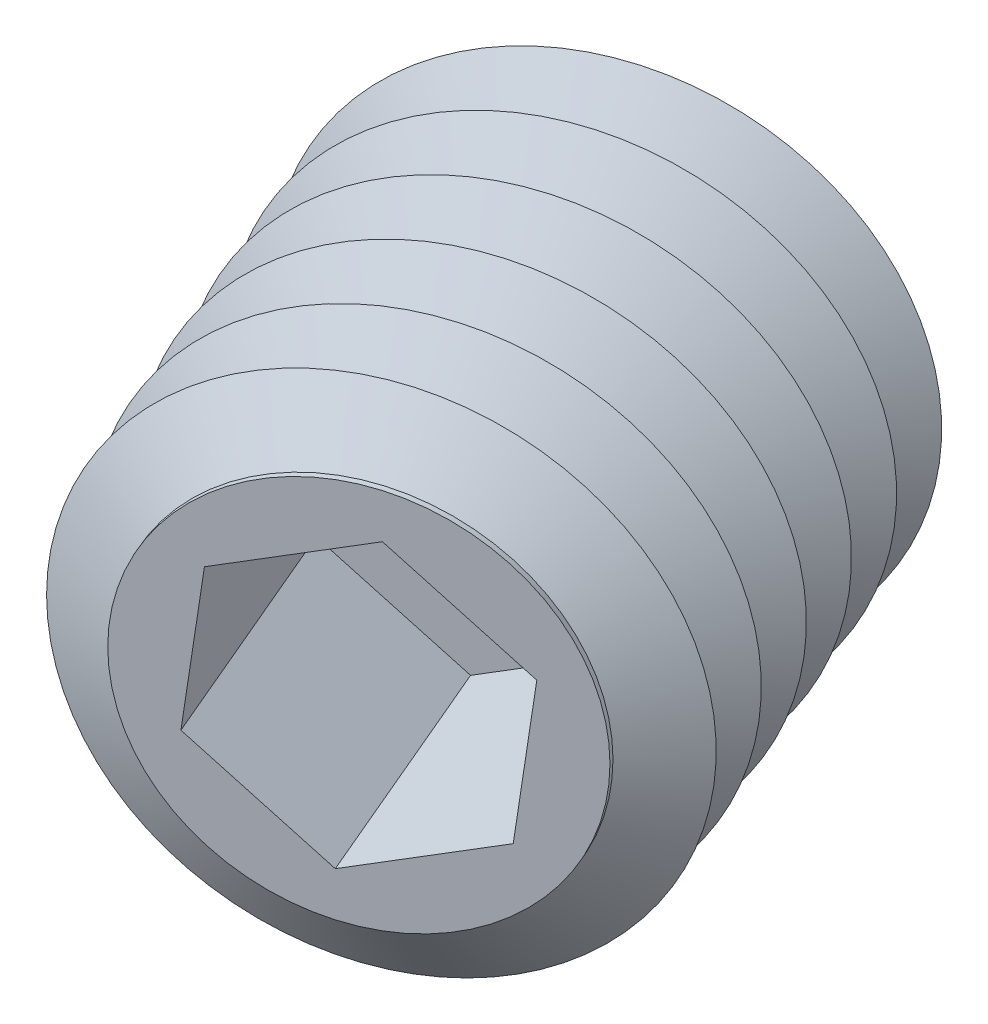
ISO-10303-21;
HEADER;
FILE_DESCRIPTION(('STEP AP214'),'2;1');
FILE_NAME('part.step','',(''),(''),'','','');
FILE_SCHEMA(('AUTOMOTIVE_DESIGN { 1 0 10303 214 1 1 1 1 }'));
ENDSEC;
DATA;
#1=APPLICATION_CONTEXT('core data for automotive mechanical design processes');
#2=APPLICATION_PROTOCOL_DEFINITION('international standard','automotive_design',2000,#1);
#3=PRODUCT_CONTEXT('',#1,'mechanical');
#4=PRODUCT('Part','Part','',(#3));
#5=PRODUCT_RELATED_PRODUCT_CATEGORY('part','',(#4));
#6=PRODUCT_DEFINITION_FORMATION('','',#4);
#7=PRODUCT_DEFINITION_CONTEXT('part definition',#1,'design');
#8=PRODUCT_DEFINITION('design','',#6,#7);
#9=PRODUCT_DEFINITION_SHAPE('','',#8);
#10=(LENGTH_UNIT() NAMED_UNIT(*) SI_UNIT(.MILLI.,.METRE.));
#11=(NAMED_UNIT(*) PLANE_ANGLE_UNIT() SI_UNIT($,.RADIAN.));
#12=(NAMED_UNIT(*) SI_UNIT($,.STERADIAN.) SOLID_ANGLE_UNIT());
#13=UNCERTAINTY_MEASURE_WITH_UNIT(LENGTH_MEASURE(1.E-05),#10,'distance_accuracy_value','');
#14=(GEOMETRIC_REPRESENTATION_CONTEXT(3) GLOBAL_UNCERTAINTY_ASSIGNED_CONTEXT((#13)) GLOBAL_UNIT_ASSIGNED_CONTEXT((#10,
#11,#12)) REPRESENTATION_CONTEXT('',''));
#15=CARTESIAN_POINT('',(0.,0.,0.));
#16=DIRECTION('',(0.,0.,1.));
#17=DIRECTION('',(1.,0.,0.));
#18=AXIS2_PLACEMENT_3D('',#15,#16,#17);
#19=CARTESIAN_POINT('',(53.6140702150309,-7.80000000000007,152.883076301382));
#20=DIRECTION('',(-0.390731128489286,0.,-0.920504853452435));
#21=DIRECTION('',(-0.920504853452435,0.,0.390731128489286));
#22=AXIS2_PLACEMENT_3D('',#19,#20,#21);
#23=CONICAL_SURFACE('',#22,1.99999999996604,0.785398163382625);
#24=CARTESIAN_POINT('',(54.3955324720193,-7.80000000000006,154.72408600831));
#25=VERTEX_POINT('',#24);
#26=VERTEX_LOOP('',#25);
#27=FACE_BOUND('',#26,.T.);
#28=CARTESIAN_POINT('',(53.6140702150309,-7.80000000000007,152.883076301382));
#29=DIRECTION('',(0.390731128489286,0.,0.920504853452435));
#30=DIRECTION('',(0.,-1.,0.));
#31=AXIS2_PLACEMENT_3D('',#28,#29,#30);
#32=CIRCLE('',#31,1.99999999996599);
#33=CARTESIAN_POINT('',(53.6140702150309,-9.79999999996606,152.883076301382));
#34=VERTEX_POINT('',#33);
#35=EDGE_CURVE('E331',#34,#34,#32,.T.);
#36=ORIENTED_EDGE('',*,*,#35,.F.);
#37=EDGE_LOOP('',(#36));
#38=FACE_BOUND('',#37,.T.);
#39=ADVANCED_FACE('F16',(#27,#38),#23,.F.);
#40=CARTESIAN_POINT('',(53.6271572263265,-7.80000000000007,152.913907367904));
#41=DIRECTION('',(0.390731128489274,0.,0.92050485345244));
#42=DIRECTION('',(0.,-1.,0.));
#43=AXIS2_PLACEMENT_3D('',#40,#41,#42);
#44=CYLINDRICAL_SURFACE('',#43,2.25);
#45=CARTESIAN_POINT('',(53.6140702150345,-7.80000000000007,152.883076301391));
#46=DIRECTION('',(-0.390731128489274,0.,-0.92050485345244));
#47=DIRECTION('',(-0.92050485345244,0.,0.390731128489274));
#48=AXIS2_PLACEMENT_3D('',#45,#46,#47);
#49=CIRCLE('',#48,2.25);
#50=CARTESIAN_POINT('',(51.5429342947665,-7.80000000000007,153.762221340491));
#51=VERTEX_POINT('',#50);
#52=EDGE_CURVE('E118',#51,#51,#49,.T.);
#53=ORIENTED_EDGE('',*,*,#52,.F.);
#54=EDGE_LOOP('',(#53));
#55=FACE_BOUND('',#54,.T.);
#56=CARTESIAN_POINT('',(53.6402442376186,-7.80000000000007,152.944738434418));
#57=DIRECTION('',(-0.390731128489274,0.,-0.92050485345244));
#58=DIRECTION('',(-0.92050485345244,0.,0.390731128489274));
#59=AXIS2_PLACEMENT_3D('',#56,#57,#58);
#60=CIRCLE('',#59,2.25);
#61=CARTESIAN_POINT('',(51.5691083173506,-7.80000000000007,153.823883473519));
#62=VERTEX_POINT('',#61);
#63=EDGE_CURVE('E11',#62,#62,#60,.T.);
#64=ORIENTED_EDGE('',*,*,#63,.T.);
#65=EDGE_LOOP('',(#64));
#66=FACE_BOUND('',#65,.T.);
#67=ADVANCED_FACE('F135',(#55,#66),#44,.T.);
#68=CARTESIAN_POINT('',(53.8094357793032,-7.80000000000007,153.343328728173));
#69=DIRECTION('',(0.39073112848927,0.,0.920504853452442));
#70=DIRECTION('',(0.,-1.,0.));
#71=AXIS2_PLACEMENT_3D('',#68,#69,#70);
#72=CONICAL_SURFACE('',#71,3.00000000007299,1.04719755118371);
#73=ORIENTED_EDGE('',*,*,#63,.F.);
#74=EDGE_LOOP('',(#73));
#75=FACE_BOUND('',#74,.T.);
#76=CARTESIAN_POINT('',(53.8094357792894,-7.80000000000007,153.343328728141));
#77=DIRECTION('',(-0.390731128489274,0.,-0.92050485345244));
#78=DIRECTION('',(-0.92050485345244,0.,0.390731128489274));
#79=AXIS2_PLACEMENT_3D('',#76,#77,#78);
#80=CIRCLE('',#79,3.00000000001884);
#81=CARTESIAN_POINT('',(51.0479212189147,-7.80000000000007,154.515522113616));
#82=VERTEX_POINT('',#81);
#83=EDGE_CURVE('E25',#82,#82,#80,.T.);
#84=ORIENTED_EDGE('',*,*,#83,.T.);
#85=EDGE_LOOP('',(#84));
#86=FACE_BOUND('',#85,.T.);
#87=ADVANCED_FACE('F140',(#75,#86),#72,.T.);
#88=CARTESIAN_POINT('',(53.8094357793165,-7.80000000000007,153.343328728205));
#89=DIRECTION('',(-0.390731128489284,0.,-0.920504853452436));
#90=DIRECTION('',(-0.920504853452436,0.,0.390731128489284));
#91=AXIS2_PLACEMENT_3D('',#88,#89,#90);
#92=CONICAL_SURFACE('',#91,2.9999999999349,1.04719755118649);
#93=CARTESIAN_POINT('',(53.9786273209611,-7.80000000000007,153.741919021866));
#94=DIRECTION('',(-0.390731128489274,0.,-0.92050485345244));
#95=DIRECTION('',(-0.92050485345244,0.,0.390731128489274));
#96=AXIS2_PLACEMENT_3D('',#93,#94,#95);
#97=CIRCLE('',#96,2.24999999997654);
#98=CARTESIAN_POINT('',(51.9074914007147,-7.80000000000007,154.621064060957));
#99=VERTEX_POINT('',#98);
#100=EDGE_CURVE('E337',#99,#99,#97,.T.);
#101=ORIENTED_EDGE('',*,*,#100,.T.);
#102=EDGE_LOOP('',(#101));
#103=FACE_BOUND('',#102,.T.);
#104=ORIENTED_EDGE('',*,*,#83,.F.);
#105=EDGE_LOOP('',(#104));
#106=FACE_BOUND('',#105,.T.);
#107=ADVANCED_FACE('F152',(#103,#106),#92,.T.);
#108=CARTESIAN_POINT('',(54.0048013435238,-7.80000000000007,153.803581154843));
#109=DIRECTION('',(0.390731128489274,0.,0.92050485345244));
#110=DIRECTION('',(0.,-1.,0.));
#111=AXIS2_PLACEMENT_3D('',#108,#109,#110);
#112=CYLINDRICAL_SURFACE('',#111,2.25);
#113=ORIENTED_EDGE('',*,*,#100,.F.);
#114=EDGE_LOOP('',(#113));
#115=FACE_BOUND('',#114,.T.);
#116=CARTESIAN_POINT('',(54.0309753661079,-7.80000000000007,153.865243287871));
#117=DIRECTION('',(-0.390731128489274,0.,-0.92050485345244));
#118=DIRECTION('',(-0.92050485345244,0.,0.390731128489274));
#119=AXIS2_PLACEMENT_3D('',#116,#117,#118);
#120=CIRCLE('',#119,2.25);
#121=CARTESIAN_POINT('',(51.9598394458399,-7.80000000000007,154.744388326972));
#122=VERTEX_POINT('',#121);
#123=EDGE_CURVE('E340',#122,#122,#120,.T.);
#124=ORIENTED_EDGE('',*,*,#123,.T.);
#125=EDGE_LOOP('',(#124));
#126=FACE_BOUND('',#125,.T.);
#127=ADVANCED_FACE('F148',(#115,#126),#112,.T.);
#128=CARTESIAN_POINT('',(54.2001669077402,-7.80000000000007,154.263833581503));
#129=DIRECTION('',(0.390731128489276,0.,0.920504853452439));
#130=DIRECTION('',(0.,-1.,0.));
#131=AXIS2_PLACEMENT_3D('',#128,#129,#130);
#132=CONICAL_SURFACE('',#131,2.99999999989111,1.04719755120376);
#133=ORIENTED_EDGE('',*,*,#123,.F.);
#134=EDGE_LOOP('',(#133));
#135=FACE_BOUND('',#134,.T.);
#136=CARTESIAN_POINT('',(54.2001669077627,-7.80000000000007,154.263833581556));
#137=DIRECTION('',(-0.390731128489274,0.,-0.92050485345244));
#138=DIRECTION('',(-0.92050485345244,0.,0.390731128489274));
#139=AXIS2_PLACEMENT_3D('',#136,#137,#138);
#140=CIRCLE('',#139,2.99999999999343);
#141=CARTESIAN_POINT('',(51.4386523474114,-7.80000000000007,155.436026967021));
#142=VERTEX_POINT('',#141);
#143=EDGE_CURVE('E343',#142,#142,#140,.T.);
#144=ORIENTED_EDGE('',*,*,#143,.T.);
#145=EDGE_LOOP('',(#144));
#146=FACE_BOUND('',#145,.T.);
#147=ADVANCED_FACE('F151',(#135,#146),#132,.T.);
#148=CARTESIAN_POINT('',(54.2001669077847,-7.80000000000007,154.263833581608));
#149=DIRECTION('',(-0.390731128489268,0.,-0.920504853452443));
#150=DIRECTION('',(-0.920504853452443,0.,0.390731128489268));
#151=AXIS2_PLACEMENT_3D('',#148,#149,#150);
#152=CONICAL_SURFACE('',#151,2.99999999991459,1.04719755120466);
#153=CARTESIAN_POINT('',(54.3693584494292,-7.80000000000007,154.662423875268));
#154=DIRECTION('',(-0.390731128489274,0.,-0.92050485345244));
#155=DIRECTION('',(-0.92050485345244,0.,0.390731128489274));
#156=AXIS2_PLACEMENT_3D('',#153,#154,#155);
#157=CIRCLE('',#156,2.24999999995626);
#158=CARTESIAN_POINT('',(52.2982225292015,-7.80000000000007,155.541568914352));
#159=VERTEX_POINT('',#158);
#160=EDGE_CURVE('E346',#159,#159,#157,.T.);
#161=ORIENTED_EDGE('',*,*,#160,.T.);
#162=EDGE_LOOP('',(#161));
#163=FACE_BOUND('',#162,.T.);
#164=ORIENTED_EDGE('',*,*,#143,.F.);
#165=EDGE_LOOP('',(#164));
#166=FACE_BOUND('',#165,.T.);
#167=ADVANCED_FACE('F164',(#163,#166),#152,.T.);
#168=CARTESIAN_POINT('',(54.395532472013,-7.80000000000007,154.724086008295));
#169=DIRECTION('',(0.390731128489274,0.,0.92050485345244));
#170=DIRECTION('',(0.,-1.,0.));
#171=AXIS2_PLACEMENT_3D('',#168,#169,#170);
#172=CYLINDRICAL_SURFACE('',#171,2.25);
#173=ORIENTED_EDGE('',*,*,#160,.F.);
#174=EDGE_LOOP('',(#173));
#175=FACE_BOUND('',#174,.T.);
#176=CARTESIAN_POINT('',(54.4217064945971,-7.80000000000007,154.785748141323));
#177=DIRECTION('',(-0.390731128489274,0.,-0.92050485345244));
#178=DIRECTION('',(-0.92050485345244,0.,0.390731128489274));
#179=AXIS2_PLACEMENT_3D('',#176,#177,#178);
#180=CIRCLE('',#179,2.25);
#181=CARTESIAN_POINT('',(52.3505705743291,-7.80000000000007,155.664893180424));
#182=VERTEX_POINT('',#181);
#183=EDGE_CURVE('E349',#182,#182,#180,.T.);
#184=ORIENTED_EDGE('',*,*,#183,.T.);
#185=EDGE_LOOP('',(#184));
#186=FACE_BOUND('',#185,.T.);
#187=ADVANCED_FACE('F160',(#175,#186),#172,.T.);
#188=CARTESIAN_POINT('',(54.59089803626,-7.80000000000007,155.184338435027));
#189=DIRECTION('',(0.390731128489276,0.,0.920504853452439));
#190=DIRECTION('',(0.,-1.,0.));
#191=AXIS2_PLACEMENT_3D('',#188,#189,#190);
#192=CONICAL_SURFACE('',#191,3.000000000012,1.04719755121017);
#193=ORIENTED_EDGE('',*,*,#183,.F.);
#194=EDGE_LOOP('',(#193));
#195=FACE_BOUND('',#194,.T.);
#196=CARTESIAN_POINT('',(54.59089803626,-7.80000000000007,155.184338435027));
#197=DIRECTION('',(-0.390731128489274,0.,-0.92050485345244));
#198=DIRECTION('',(-0.92050485345244,0.,0.390731128489274));
#199=AXIS2_PLACEMENT_3D('',#196,#197,#198);
#200=CIRCLE('',#199,3.00000000001199);
#201=CARTESIAN_POINT('',(51.8293834758916,-7.80000000000007,156.3565318205));
#202=VERTEX_POINT('',#201);
#203=EDGE_CURVE('E352',#202,#202,#200,.T.);
#204=ORIENTED_EDGE('',*,*,#203,.T.);
#205=EDGE_LOOP('',(#204));
#206=FACE_BOUND('',#205,.T.);
#207=ADVANCED_FACE('F163',(#195,#206),#192,.T.);
#208=CARTESIAN_POINT('',(54.5908980362615,-7.80000000000007,155.184338435031));
#209=DIRECTION('',(-0.390731128489273,0.,-0.920504853452441));
#210=DIRECTION('',(-0.920504853452441,0.,0.390731128489273));
#211=AXIS2_PLACEMENT_3D('',#208,#209,#210);
#212=CONICAL_SURFACE('',#211,2.99999999994251,1.04719755118876);
#213=CARTESIAN_POINT('',(54.7600895779265,-7.80000000000007,155.58292872874));
#214=DIRECTION('',(-0.390731128489274,0.,-0.92050485345244));
#215=DIRECTION('',(-0.92050485345244,0.,0.390731128489274));
#216=AXIS2_PLACEMENT_3D('',#213,#214,#215);
#217=CIRCLE('',#216,2.24999999997484);
#218=CARTESIAN_POINT('',(52.6889536576817,-7.80000000000007,156.462073767831));
#219=VERTEX_POINT('',#218);
#220=EDGE_CURVE('E355',#219,#219,#217,.T.);
#221=ORIENTED_EDGE('',*,*,#220,.T.);
#222=EDGE_LOOP('',(#221));
#223=FACE_BOUND('',#222,.T.);
#224=ORIENTED_EDGE('',*,*,#203,.F.);
#225=EDGE_LOOP('',(#224));
#226=FACE_BOUND('',#225,.T.);
#227=ADVANCED_FACE('F158',(#223,#226),#212,.T.);
#228=CARTESIAN_POINT('',(54.7862636005023,-7.80000000000007,155.644590861748));
#229=DIRECTION('',(0.390731128489274,0.,0.92050485345244));
#230=DIRECTION('',(0.,-1.,0.));
#231=AXIS2_PLACEMENT_3D('',#228,#229,#230);
#232=CYLINDRICAL_SURFACE('',#231,2.25);
#233=ORIENTED_EDGE('',*,*,#220,.F.);
#234=EDGE_LOOP('',(#233));
#235=FACE_BOUND('',#234,.T.);
#236=CARTESIAN_POINT('',(54.8124376230864,-7.80000000000007,155.706252994776));
#237=DIRECTION('',(-0.390731128489274,0.,-0.92050485345244));
#238=DIRECTION('',(-0.92050485345244,0.,0.390731128489274));
#239=AXIS2_PLACEMENT_3D('',#236,#237,#238);
#240=CIRCLE('',#239,2.25);
#241=CARTESIAN_POINT('',(52.7413017028184,-7.80000000000007,156.585398033877));
#242=VERTEX_POINT('',#241);
#243=EDGE_CURVE('E358',#242,#242,#240,.T.);
#244=ORIENTED_EDGE('',*,*,#243,.T.);
#245=EDGE_LOOP('',(#244));
#246=FACE_BOUND('',#245,.T.);
#247=ADVANCED_FACE('F154',(#235,#246),#232,.T.);
#248=CARTESIAN_POINT('',(54.9816291647746,-7.80000000000007,156.104843288539));
#249=DIRECTION('',(0.390731128489275,0.,0.92050485345244));
#250=DIRECTION('',(0.,-1.,0.));
#251=AXIS2_PLACEMENT_3D('',#248,#249,#250);
#252=CONICAL_SURFACE('',#251,3.00000000013798,1.04719755119727);
#253=ORIENTED_EDGE('',*,*,#243,.F.);
#254=EDGE_LOOP('',(#253));
#255=FACE_BOUND('',#254,.T.);
#256=CARTESIAN_POINT('',(54.9816291647521,-7.80000000000007,156.104843288486));
#257=DIRECTION('',(-0.390731128489274,0.,-0.92050485345244));
#258=DIRECTION('',(-0.92050485345244,0.,0.390731128489274));
#259=AXIS2_PLACEMENT_3D('',#256,#257,#258);
#260=CIRCLE('',#259,3.00000000002455);
#261=CARTESIAN_POINT('',(52.2201146043722,-7.80000000000007,157.277036673964));
#262=VERTEX_POINT('',#261);
#263=EDGE_CURVE('E361',#262,#262,#260,.T.);
#264=ORIENTED_EDGE('',*,*,#263,.T.);
#265=EDGE_LOOP('',(#264));
#266=FACE_BOUND('',#265,.T.);
#267=ADVANCED_FACE('F157',(#255,#266),#252,.T.);
#268=CARTESIAN_POINT('',(54.9816291647706,-7.80000000000007,156.10484328853));
#269=DIRECTION('',(-0.390731128489278,0.,-0.920504853452439));
#270=DIRECTION('',(-0.920504853452439,0.,0.390731128489278));
#271=AXIS2_PLACEMENT_3D('',#268,#269,#270);
#272=CONICAL_SURFACE('',#271,2.99999999987023,1.04719755119106);
#273=CARTESIAN_POINT('',(55.1508207064034,-7.80000000000007,156.503433582163));
#274=DIRECTION('',(-0.390731128489274,0.,-0.92050485345244));
#275=DIRECTION('',(-0.92050485345244,0.,0.390731128489274));
#276=AXIS2_PLACEMENT_3D('',#273,#274,#275);
#277=CIRCLE('',#276,2.25000000000271);
#278=CARTESIAN_POINT('',(53.0796847861329,-7.80000000000007,157.382578621265));
#279=VERTEX_POINT('',#278);
#280=EDGE_CURVE('E226',#279,#279,#277,.T.);
#281=ORIENTED_EDGE('',*,*,#280,.T.);
#282=EDGE_LOOP('',(#281));
#283=FACE_BOUND('',#282,.T.);
#284=ORIENTED_EDGE('',*,*,#263,.F.);
#285=EDGE_LOOP('',(#284));
#286=FACE_BOUND('',#285,.T.);
#287=ADVANCED_FACE('F176',(#283,#286),#272,.T.);
#288=CARTESIAN_POINT('',(55.1769947289916,-7.80000000000007,156.5650957152));
#289=DIRECTION('',(0.390731128489274,0.,0.92050485345244));
#290=DIRECTION('',(0.,-1.,0.));
#291=AXIS2_PLACEMENT_3D('',#288,#289,#290);
#292=CYLINDRICAL_SURFACE('',#291,2.25);
#293=ORIENTED_EDGE('',*,*,#280,.F.);
#294=EDGE_LOOP('',(#293));
#295=FACE_BOUND('',#294,.T.);
#296=CARTESIAN_POINT('',(55.2031687515757,-7.80000000000007,156.626757848228));
#297=DIRECTION('',(-0.390731128489274,0.,-0.92050485345244));
#298=DIRECTION('',(-0.92050485345244,0.,0.390731128489274));
#299=AXIS2_PLACEMENT_3D('',#296,#297,#298);
#300=CIRCLE('',#299,2.25);
#301=CARTESIAN_POINT('',(53.1320328313077,-7.80000000000007,157.505902887329));
#302=VERTEX_POINT('',#301);
#303=EDGE_CURVE('E219',#302,#302,#300,.T.);
#304=ORIENTED_EDGE('',*,*,#303,.T.);
#305=EDGE_LOOP('',(#304));
#306=FACE_BOUND('',#305,.T.);
#307=ADVANCED_FACE('F172',(#295,#306),#292,.T.);
#308=CARTESIAN_POINT('',(55.3723602932356,-7.80000000000007,157.025348141925));
#309=DIRECTION('',(0.390731128489277,0.,0.920504853452439));
#310=DIRECTION('',(0.,-1.,0.));
#311=AXIS2_PLACEMENT_3D('',#308,#309,#310);
#312=CONICAL_SURFACE('',#311,2.99999999996675,1.04719755117974);
#313=ORIENTED_EDGE('',*,*,#303,.F.);
#314=EDGE_LOOP('',(#313));
#315=FACE_BOUND('',#314,.T.);
#316=CARTESIAN_POINT('',(55.3723602932356,-7.80000000000007,157.025348141925));
#317=DIRECTION('',(-0.390731128489274,0.,-0.92050485345244));
#318=DIRECTION('',(-0.92050485345244,0.,0.390731128489274));
#319=AXIS2_PLACEMENT_3D('',#316,#317,#318);
#320=CIRCLE('',#319,2.99999999996674);
#321=CARTESIAN_POINT('',(52.6108457329089,-7.80000000000007,158.19754152738));
#322=VERTEX_POINT('',#321);
#323=EDGE_CURVE('E222',#322,#322,#320,.T.);
#324=ORIENTED_EDGE('',*,*,#323,.T.);
#325=EDGE_LOOP('',(#324));
#326=FACE_BOUND('',#325,.T.);
#327=ADVANCED_FACE('F175',(#315,#326),#312,.T.);
#328=CARTESIAN_POINT('',(55.3723602932679,-7.80000000000007,157.025348142001));
#329=DIRECTION('',(-0.390731128489272,0.,-0.920504853452441));
#330=DIRECTION('',(-0.920504853452441,0.,0.390731128489272));
#331=AXIS2_PLACEMENT_3D('',#328,#329,#330);
#332=CONICAL_SURFACE('',#331,2.99999999987769,1.04719755123238);
#333=CARTESIAN_POINT('',(55.5415518349007,-7.80000000000007,157.423938435634));
#334=DIRECTION('',(-0.390731128489274,0.,-0.92050485345244));
#335=DIRECTION('',(-0.92050485345244,0.,0.390731128489274));
#336=AXIS2_PLACEMENT_3D('',#333,#334,#335);
#337=CIRCLE('',#336,2.25000000001016);
#338=CARTESIAN_POINT('',(53.4704159146233,-7.80000000000007,158.303083474739));
#339=VERTEX_POINT('',#338);
#340=EDGE_CURVE('E224',#339,#339,#337,.T.);
#341=ORIENTED_EDGE('',*,*,#340,.T.);
#342=EDGE_LOOP('',(#341));
#343=FACE_BOUND('',#342,.T.);
#344=ORIENTED_EDGE('',*,*,#323,.F.);
#345=EDGE_LOOP('',(#344));
#346=FACE_BOUND('',#345,.T.);
#347=ADVANCED_FACE('F181',(#343,#346),#332,.T.);
#348=CARTESIAN_POINT('',(55.5677258574809,-7.80000000000007,157.485600568653));
#349=DIRECTION('',(0.390731128489274,0.,0.92050485345244));
#350=DIRECTION('',(0.,-1.,0.));
#351=AXIS2_PLACEMENT_3D('',#348,#349,#350);
#352=CYLINDRICAL_SURFACE('',#351,2.25);
#353=ORIENTED_EDGE('',*,*,#340,.F.);
#354=EDGE_LOOP('',(#353));
#355=FACE_BOUND('',#354,.T.);
#356=CARTESIAN_POINT('',(55.5938998800649,-7.80000000000007,157.547262701681));
#357=DIRECTION('',(-0.390731128489274,0.,-0.92050485345244));
#358=DIRECTION('',(-0.92050485345244,0.,0.390731128489274));
#359=AXIS2_PLACEMENT_3D('',#356,#357,#358);
#360=CIRCLE('',#359,2.25);
#361=CARTESIAN_POINT('',(53.522763959797,-7.80000000000007,158.426407740781));
#362=VERTEX_POINT('',#361);
#363=EDGE_CURVE('E229',#362,#362,#360,.T.);
#364=ORIENTED_EDGE('',*,*,#363,.T.);
#365=EDGE_LOOP('',(#364));
#366=FACE_BOUND('',#365,.T.);
#367=ADVANCED_FACE('F184',(#355,#366),#352,.T.);
#368=CARTESIAN_POINT('',(55.7630914217641,-7.80000000000007,157.94585299547));
#369=DIRECTION('',(0.390731128489277,0.,0.920504853452439));
#370=DIRECTION('',(0.,-1.,0.));
#371=AXIS2_PLACEMENT_3D('',#368,#369,#370);
#372=CONICAL_SURFACE('',#371,3.00000000014688,1.04719755119729);
#373=ORIENTED_EDGE('',*,*,#363,.F.);
#374=EDGE_LOOP('',(#373));
#375=FACE_BOUND('',#374,.T.);
#376=CARTESIAN_POINT('',(55.7630914217365,-7.80000000000007,157.945852995405));
#377=DIRECTION('',(-0.390731128489274,0.,-0.92050485345244));
#378=DIRECTION('',(-0.92050485345244,0.,0.390731128489274));
#379=AXIS2_PLACEMENT_3D('',#376,#377,#378);
#380=CIRCLE('',#379,3.00000000004966);
#381=CARTESIAN_POINT('',(53.0015768613335,-7.80000000000007,159.118046380892));
#382=VERTEX_POINT('',#381);
#383=EDGE_CURVE('E235',#382,#382,#380,.T.);
#384=ORIENTED_EDGE('',*,*,#383,.T.);
#385=EDGE_LOOP('',(#384));
#386=FACE_BOUND('',#385,.T.);
#387=ADVANCED_FACE('F18',(#375,#386),#372,.T.);
#388=CARTESIAN_POINT('',(55.7630914217447,-7.80000000000007,157.945852995424));
#389=DIRECTION('',(-0.390731128489272,0.,-0.920504853452441));
#390=DIRECTION('',(-0.920504853452441,0.,0.390731128489272));
#391=AXIS2_PLACEMENT_3D('',#388,#389,#390);
#392=CONICAL_SURFACE('',#391,2.9999999999167,1.04719755125472);
#393=CARTESIAN_POINT('',(55.9322829633775,-7.80000000000007,158.344443289057));
#394=DIRECTION('',(-0.390731128489274,0.,-0.92050485345244));
#395=DIRECTION('',(-0.92050485345244,0.,0.390731128489274));
#396=AXIS2_PLACEMENT_3D('',#393,#394,#395);
#397=CIRCLE('',#396,2.25000000004915);
#398=CARTESIAN_POINT('',(53.8611470430643,-7.80000000000007,159.223588328177));
#399=VERTEX_POINT('',#398);
#400=EDGE_CURVE('E238',#399,#399,#397,.T.);
#401=ORIENTED_EDGE('',*,*,#400,.T.);
#402=EDGE_LOOP('',(#401));
#403=FACE_BOUND('',#402,.T.);
#404=ORIENTED_EDGE('',*,*,#383,.F.);
#405=EDGE_LOOP('',(#404));
#406=FACE_BOUND('',#405,.T.);
#407=ADVANCED_FACE('F196',(#403,#406),#392,.T.);
#408=CARTESIAN_POINT('',(55.9453699746781,-7.80000000000007,158.375274355591));
#409=DIRECTION('',(0.390731128489274,0.,0.92050485345244));
#410=DIRECTION('',(0.,-1.,0.));
#411=AXIS2_PLACEMENT_3D('',#408,#409,#410);
#412=CYLINDRICAL_SURFACE('',#411,2.25);
#413=ORIENTED_EDGE('',*,*,#400,.F.);
#414=EDGE_LOOP('',(#413));
#415=FACE_BOUND('',#414,.T.);
#416=CARTESIAN_POINT('',(55.9584569859701,-7.80000000000007,158.406105422105));
#417=DIRECTION('',(-0.390731128489274,0.,-0.92050485345244));
#418=DIRECTION('',(-0.92050485345244,0.,0.390731128489274));
#419=AXIS2_PLACEMENT_3D('',#416,#417,#418);
#420=CIRCLE('',#419,2.25);
#421=CARTESIAN_POINT('',(53.8873210657021,-7.80000000000007,159.285250461206));
#422=VERTEX_POINT('',#421);
#423=EDGE_CURVE('E241',#422,#422,#420,.T.);
#424=ORIENTED_EDGE('',*,*,#423,.T.);
#425=EDGE_LOOP('',(#424));
#426=FACE_BOUND('',#425,.T.);
#427=ADVANCED_FACE('F192',(#415,#426),#412,.T.);
#428=CARTESIAN_POINT('',(53.3186464009489,-8.47676616664219,156.267557402794));
#429=DIRECTION('',(-0.913643549861379,0.121869343405148,0.387818677908499));
#430=DIRECTION('',(0.390731128489274,0.,0.92050485345244));
#431=AXIS2_PLACEMENT_3D('',#428,#429,#430);
#432=PLANE('',#431);
#433=DIRECTION('',(-0.390731128489275,0.,-0.92050485345244));
#434=VECTOR('',#433,1.);
#435=CARTESIAN_POINT('',(54.4908397864167,-8.47676616664218,159.029071963152));
#436=LINE('',#435,#434);
#437=CARTESIAN_POINT('',(54.4908397864167,-8.47676616664219,159.029071963152));
#438=VERTEX_POINT('',#437);
#439=CARTESIAN_POINT('',(53.3186464009489,-8.47676616664219,156.267557402794));
#440=VERTEX_POINT('',#439);
#441=EDGE_CURVE('E244',#438,#440,#436,.T.);
#442=ORIENTED_EDGE('',*,*,#441,.T.);
#443=DIRECTION('',(-0.112181322091501,-0.992546151641322,0.0476181460769404));
#444=VECTOR('',#443,1.);
#445=CARTESIAN_POINT('',(53.3186464009489,-8.47676616664219,156.267557402794));
#446=LINE('',#445,#444);
#447=CARTESIAN_POINT('',(53.5129501504716,-6.75762580314247,156.185080354427));
#448=VERTEX_POINT('',#447);
#449=EDGE_CURVE('E37',#448,#440,#446,.T.);
#450=ORIENTED_EDGE('',*,*,#449,.F.);
#451=DIRECTION('',(0.390731128489273,0.,0.920504853452441));
#452=VECTOR('',#451,1.);
#453=CARTESIAN_POINT('',(53.5129501504716,-6.75762580314248,156.185080354427));
#454=LINE('',#453,#452);
#455=CARTESIAN_POINT('',(54.6851435359394,-6.75762580314247,158.946594914784));
#456=VERTEX_POINT('',#455);
#457=EDGE_CURVE('E245',#448,#456,#454,.T.);
#458=ORIENTED_EDGE('',*,*,#457,.T.);
#459=DIRECTION('',(0.112181322091501,0.992546151641322,-0.0476181460769404));
#460=VECTOR('',#459,1.);
#461=CARTESIAN_POINT('',(54.4908397864167,-8.47676616664219,159.029071963152));
#462=LINE('',#461,#460);
#463=EDGE_CURVE('E97',#438,#456,#462,.T.);
#464=ORIENTED_EDGE('',*,*,#463,.F.);
#465=EDGE_LOOP('',(#442,#450,#458,#464));
#466=FACE_BOUND('',#465,.T.);
#467=ADVANCED_FACE('F195',(#466),#432,.F.);
#468=CARTESIAN_POINT('',(54.5919598509796,-9.51914036349979,155.727067910115));
#469=DIRECTION('',(-0.553973649692054,-0.798635510047292,0.235147863137999));
#470=DIRECTION('',(0.821675615177147,-0.569955422312356,0.));
#471=AXIS2_PLACEMENT_3D('',#468,#469,#470);
#472=PLANE('',#471);
#473=DIRECTION('',(-0.390731128489271,0.,-0.920504853452441));
#474=VECTOR('',#473,1.);
#475=CARTESIAN_POINT('',(55.7641532364474,-9.5191403634998,158.488582470473));
#476=LINE('',#475,#474);
#477=CARTESIAN_POINT('',(55.7641532364474,-9.51914036349979,158.488582470473));
#478=VERTEX_POINT('',#477);
#479=CARTESIAN_POINT('',(54.5919598509796,-9.51914036349979,155.727067910115));
#480=VERTEX_POINT('',#479);
#481=EDGE_CURVE('E110',#478,#480,#476,.T.);
#482=ORIENTED_EDGE('',*,*,#481,.T.);
#483=DIRECTION('',(0.735147863137989,-0.601815023152049,-0.312051754092405));
#484=VECTOR('',#483,1.);
#485=CARTESIAN_POINT('',(53.3186464009489,-8.47676616664218,156.267557402794));
#486=LINE('',#485,#484);
#487=EDGE_CURVE('E104',#440,#480,#486,.T.);
#488=ORIENTED_EDGE('',*,*,#487,.F.);
#489=ORIENTED_EDGE('',*,*,#441,.F.);
#490=DIRECTION('',(-0.735147863137995,0.60181502315205,0.312051754092391));
#491=VECTOR('',#490,1.);
#492=CARTESIAN_POINT('',(55.7641532364474,-9.51914036349978,158.488582470473));
#493=LINE('',#492,#491);
#494=EDGE_CURVE('E94',#478,#438,#493,.T.);
#495=ORIENTED_EDGE('',*,*,#494,.F.);
#496=EDGE_LOOP('',(#482,#488,#489,#495));
#497=FACE_BOUND('',#496,.T.);
#498=ADVANCED_FACE('F254',(#497),#472,.F.);
#499=CARTESIAN_POINT('',(53.5129501504716,-6.75762580314248,156.185080354427));
#500=DIRECTION('',(-0.359669900169325,0.920504853452441,0.152670814770501));
#501=DIRECTION('',(-0.931423843949237,-0.363936289648102,0.));
#502=AXIS2_PLACEMENT_3D('',#499,#500,#501);
#503=PLANE('',#502);
#504=ORIENTED_EDGE('',*,*,#457,.F.);
#505=DIRECTION('',(0.847329185229502,0.390731128489259,-0.359669900169334));
#506=VECTOR('',#505,1.);
#507=CARTESIAN_POINT('',(53.5129501504716,-6.75762580314248,156.185080354427));
#508=LINE('',#507,#506);
#509=CARTESIAN_POINT('',(54.980567350025,-6.08085963650035,155.56211381338));
#510=VERTEX_POINT('',#509);
#511=EDGE_CURVE('E113',#448,#510,#508,.T.);
#512=ORIENTED_EDGE('',*,*,#511,.T.);
#513=DIRECTION('',(0.390731128489275,0.,0.92050485345244));
#514=VECTOR('',#513,1.);
#515=CARTESIAN_POINT('',(54.980567350025,-6.08085963650035,155.56211381338));
#516=LINE('',#515,#514);
#517=CARTESIAN_POINT('',(56.1527607354928,-6.08085963650034,158.323628373738));
#518=VERTEX_POINT('',#517);
#519=EDGE_CURVE('E116',#510,#518,#516,.T.);
#520=ORIENTED_EDGE('',*,*,#519,.T.);
#521=DIRECTION('',(0.847329185229496,0.390731128489272,-0.359669900169334));
#522=VECTOR('',#521,1.);
#523=CARTESIAN_POINT('',(54.6851435359394,-6.75762580314247,158.946594914784));
#524=LINE('',#523,#522);
#525=EDGE_CURVE('E76',#456,#518,#524,.T.);
#526=ORIENTED_EDGE('',*,*,#525,.F.);
#527=EDGE_LOOP('',(#504,#512,#520,#526));
#528=FACE_BOUND('',#527,.T.);
#529=ADVANCED_FACE('F132',(#528),#503,.F.);
#530=CARTESIAN_POINT('',(56.059577050533,-8.84237419685766,155.104101369069));
#531=DIRECTION('',(0.359669900169325,-0.920504853452441,-0.152670814770501));
#532=DIRECTION('',(0.931423843949237,0.363936289648102,0.));
#533=AXIS2_PLACEMENT_3D('',#530,#531,#532);
#534=PLANE('',#533);
#535=DIRECTION('',(-0.390731128489274,0.,-0.92050485345244));
#536=VECTOR('',#535,1.);
#537=CARTESIAN_POINT('',(56.059577050533,-8.84237419685766,155.104101369069));
#538=LINE('',#537,#536);
#539=CARTESIAN_POINT('',(57.2317704360008,-8.84237419685766,157.865615929426));
#540=VERTEX_POINT('',#539);
#541=CARTESIAN_POINT('',(56.059577050533,-8.84237419685766,155.104101369069));
#542=VERTEX_POINT('',#541);
#543=EDGE_CURVE('E92',#540,#542,#538,.T.);
#544=ORIENTED_EDGE('',*,*,#543,.T.);
#545=DIRECTION('',(-0.8473291852295,-0.390731128489262,0.359669900169336));
#546=VECTOR('',#545,1.);
#547=CARTESIAN_POINT('',(56.059577050533,-8.84237419685766,155.104101369069));
#548=LINE('',#547,#546);
#549=EDGE_CURVE('E101',#542,#480,#548,.T.);
#550=ORIENTED_EDGE('',*,*,#549,.T.);
#551=ORIENTED_EDGE('',*,*,#481,.F.);
#552=DIRECTION('',(-0.847329185229501,-0.390731128489273,0.35966990016932));
#553=VECTOR('',#552,1.);
#554=CARTESIAN_POINT('',(57.2317704360008,-8.84237419685766,157.865615929426));
#555=LINE('',#554,#553);
#556=EDGE_CURVE('E93',#540,#478,#555,.T.);
#557=ORIENTED_EDGE('',*,*,#556,.F.);
#558=EDGE_LOOP('',(#544,#550,#551,#557));
#559=FACE_BOUND('',#558,.T.);
#560=ADVANCED_FACE('F122',(#559),#534,.F.);
#561=CARTESIAN_POINT('',(54.7862636005023,-7.80000000000007,155.644590861748));
#562=DIRECTION('',(-0.390731128489274,0.,-0.92050485345244));
#563=DIRECTION('',(-0.92050485345244,0.,0.390731128489274));
#564=AXIS2_PLACEMENT_3D('',#561,#562,#563);
#565=PLANE('',#564);
#566=DIRECTION('',(-0.735147863138004,0.601815023152048,0.312051754092374));
#567=VECTOR('',#566,1.);
#568=CARTESIAN_POINT('',(56.2538808000558,-7.12323383335795,155.021624320701));
#569=LINE('',#568,#567);
#570=CARTESIAN_POINT('',(56.2538808000557,-7.12323383335797,155.021624320701));
#571=VERTEX_POINT('',#570);
#572=EDGE_CURVE('E84',#571,#510,#569,.T.);
#573=ORIENTED_EDGE('',*,*,#572,.T.);
#574=ORIENTED_EDGE('',*,*,#511,.F.);
#575=ORIENTED_EDGE('',*,*,#449,.T.);
#576=ORIENTED_EDGE('',*,*,#487,.T.);
#577=ORIENTED_EDGE('',*,*,#549,.F.);
#578=DIRECTION('',(0.1121813220915,0.992546151641322,-0.0476181460769401));
#579=VECTOR('',#578,1.);
#580=CARTESIAN_POINT('',(56.2538808000557,-7.12323383335797,155.021624320701));
#581=LINE('',#580,#579);
#582=EDGE_CURVE('E87',#542,#571,#581,.T.);
#583=ORIENTED_EDGE('',*,*,#582,.T.);
#584=EDGE_LOOP('',(#573,#574,#575,#576,#577,#583));
#585=FACE_BOUND('',#584,.T.);
#586=ADVANCED_FACE('F123',(#585),#565,.F.);
#587=CARTESIAN_POINT('',(54.980567350025,-6.08085963650035,155.56211381338));
#588=DIRECTION('',(0.553973649692054,0.798635510047293,-0.235147863137998));
#589=DIRECTION('',(-0.821675615177148,0.569955422312355,0.));
#590=AXIS2_PLACEMENT_3D('',#587,#588,#589);
#591=PLANE('',#590);
#592=ORIENTED_EDGE('',*,*,#519,.F.);
#593=ORIENTED_EDGE('',*,*,#572,.F.);
#594=DIRECTION('',(0.390731128489274,0.,0.92050485345244));
#595=VECTOR('',#594,1.);
#596=CARTESIAN_POINT('',(56.2538808000557,-7.12323383335797,155.021624320701));
#597=LINE('',#596,#595);
#598=CARTESIAN_POINT('',(57.4260741855236,-7.12323383335796,157.783138881059));
#599=VERTEX_POINT('',#598);
#600=EDGE_CURVE('E79',#571,#599,#597,.T.);
#601=ORIENTED_EDGE('',*,*,#600,.T.);
#602=DIRECTION('',(0.735147863138002,-0.601815023152049,-0.312051754092375));
#603=VECTOR('',#602,1.);
#604=CARTESIAN_POINT('',(56.1527607354929,-6.08085963650035,158.323628373738));
#605=LINE('',#604,#603);
#606=EDGE_CURVE('E70',#518,#599,#605,.T.);
#607=ORIENTED_EDGE('',*,*,#606,.F.);
#608=EDGE_LOOP('',(#592,#593,#601,#607));
#609=FACE_BOUND('',#608,.T.);
#610=ADVANCED_FACE('F82',(#609),#591,.F.);
#611=CARTESIAN_POINT('',(56.2538808000557,-7.12323383335797,155.021624320701));
#612=DIRECTION('',(0.913643549861379,-0.121869343405148,-0.387818677908499));
#613=DIRECTION('',(-0.390731128489274,0.,-0.92050485345244));
#614=AXIS2_PLACEMENT_3D('',#611,#612,#613);
#615=PLANE('',#614);
#616=ORIENTED_EDGE('',*,*,#600,.F.);
#617=ORIENTED_EDGE('',*,*,#582,.F.);
#618=ORIENTED_EDGE('',*,*,#543,.F.);
#619=DIRECTION('',(-0.112181322091508,-0.992546151641321,0.0476181460769442));
#620=VECTOR('',#619,1.);
#621=CARTESIAN_POINT('',(57.4260741855236,-7.12323383335797,157.783138881059));
#622=LINE('',#621,#620);
#623=EDGE_CURVE('E20',#599,#540,#622,.T.);
#624=ORIENTED_EDGE('',*,*,#623,.F.);
#625=EDGE_LOOP('',(#616,#617,#618,#624));
#626=FACE_BOUND('',#625,.T.);
#627=ADVANCED_FACE('F90',(#626),#615,.F.);
#628=CARTESIAN_POINT('',(56.9117023193533,-7.36042748044963,158.001476784415));
#629=DIRECTION('',(0.390731128489274,0.,0.92050485345244));
#630=DIRECTION('',(0.92050485345244,0.,-0.390731128489274));
#631=AXIS2_PLACEMENT_3D('',#628,#629,#630);
#632=PLANE('',#631);
#633=ORIENTED_EDGE('',*,*,#423,.F.);
#634=EDGE_LOOP('',(#633));
#635=FACE_BOUND('',#634,.T.);
#636=ORIENTED_EDGE('',*,*,#606,.T.);
#637=ORIENTED_EDGE('',*,*,#623,.T.);
#638=ORIENTED_EDGE('',*,*,#556,.T.);
#639=ORIENTED_EDGE('',*,*,#494,.T.);
#640=ORIENTED_EDGE('',*,*,#463,.T.);
#641=ORIENTED_EDGE('',*,*,#525,.T.);
#642=EDGE_LOOP('',(#636,#637,#638,#639,#640,#641));
#643=FACE_BOUND('',#642,.T.);
#644=ADVANCED_FACE('F72',(#635,#643),#632,.T.);
#645=CARTESIAN_POINT('',(54.5673155484177,-7.36042748044963,152.4784476637));
#646=DIRECTION('',(-0.390731128489274,0.,-0.92050485345244));
#647=DIRECTION('',(-0.92050485345244,0.,0.390731128489274));
#648=AXIS2_PLACEMENT_3D('',#645,#646,#647);
#649=PLANE('',#648);
#650=ORIENTED_EDGE('',*,*,#52,.T.);
#651=EDGE_LOOP('',(#650));
#652=FACE_BOUND('',#651,.T.);
#653=ORIENTED_EDGE('',*,*,#35,.T.);
#654=EDGE_LOOP('',(#653));
#655=FACE_BOUND('',#654,.T.);
#656=ADVANCED_FACE('F145',(#652,#655),#649,.T.);
#657=CLOSED_SHELL('',(#39,#67,#87,#107,#127,#147,#167,#187,#207,#227,#247,#267,#287,#307,#327,
#347,#367,#387,#407,#427,#467,#498,#529,#560,#586,#610,#627,#644,#656));
#658=MANIFOLD_SOLID_BREP('B1',#657);
#659=ADVANCED_BREP_SHAPE_REPRESENTATION('',(#18,#658),#14);
#660=SHAPE_DEFINITION_REPRESENTATION(#9,#659);
ENDSEC;
END-ISO-10303-21;
